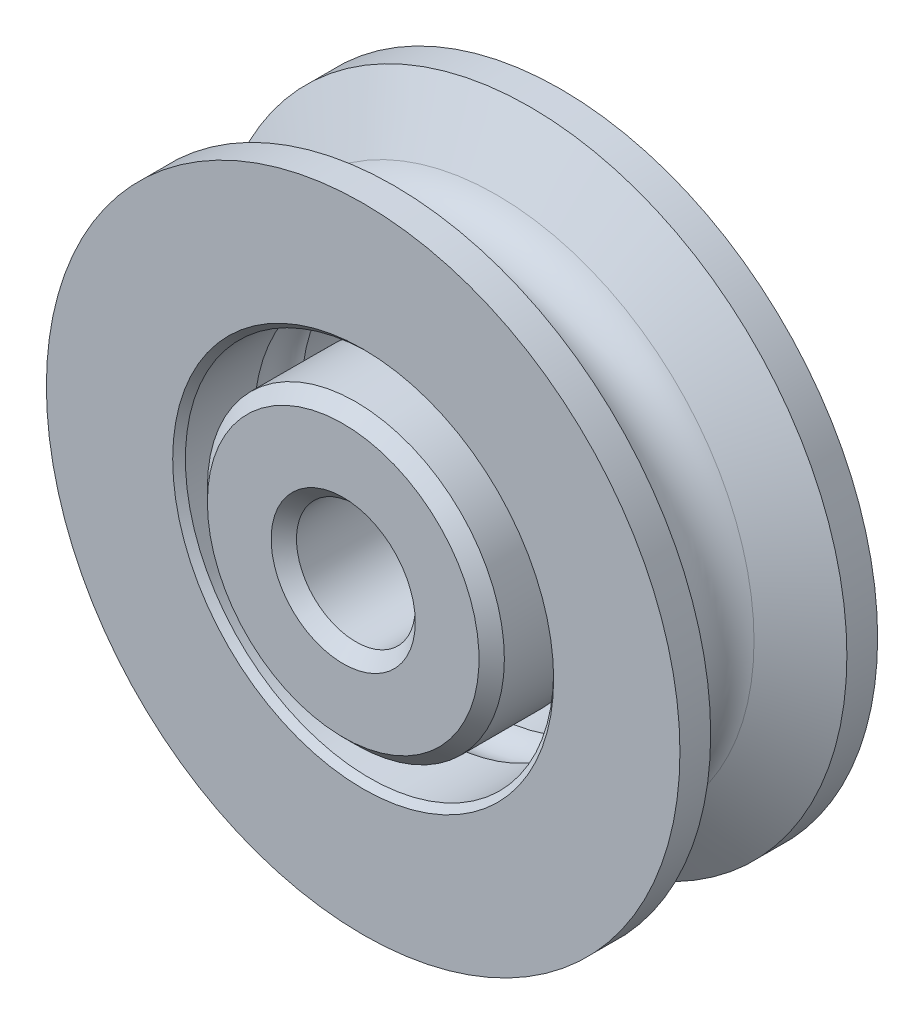
ISO-10303-21;
HEADER;
FILE_DESCRIPTION(('STEP AP214'),'2;1');
FILE_NAME('part.step','',(''),(''),'','','');
FILE_SCHEMA(('AUTOMOTIVE_DESIGN { 1 0 10303 214 1 1 1 1 }'));
ENDSEC;
DATA;
#1=APPLICATION_CONTEXT('core data for automotive mechanical design processes');
#2=APPLICATION_PROTOCOL_DEFINITION('international standard','automotive_design',2000,#1);
#3=PRODUCT_CONTEXT('',#1,'mechanical');
#4=PRODUCT('Part','Part','',(#3));
#5=PRODUCT_RELATED_PRODUCT_CATEGORY('part','',(#4));
#6=PRODUCT_DEFINITION_FORMATION('','',#4);
#7=PRODUCT_DEFINITION_CONTEXT('part definition',#1,'design');
#8=PRODUCT_DEFINITION('design','',#6,#7);
#9=PRODUCT_DEFINITION_SHAPE('','',#8);
#10=(LENGTH_UNIT() NAMED_UNIT(*) SI_UNIT(.MILLI.,.METRE.));
#11=(NAMED_UNIT(*) PLANE_ANGLE_UNIT() SI_UNIT($,.RADIAN.));
#12=(NAMED_UNIT(*) SI_UNIT($,.STERADIAN.) SOLID_ANGLE_UNIT());
#13=UNCERTAINTY_MEASURE_WITH_UNIT(LENGTH_MEASURE(1.E-05),#10,'distance_accuracy_value','');
#14=(GEOMETRIC_REPRESENTATION_CONTEXT(3) GLOBAL_UNCERTAINTY_ASSIGNED_CONTEXT((#13)) GLOBAL_UNIT_ASSIGNED_CONTEXT((#10,
#11,#12)) REPRESENTATION_CONTEXT('',''));
#15=CARTESIAN_POINT('',(0.,0.,0.));
#16=DIRECTION('',(0.,0.,1.));
#17=DIRECTION('',(1.,0.,0.));
#18=AXIS2_PLACEMENT_3D('',#15,#16,#17);
#19=CARTESIAN_POINT('',(0.,0.,4.25450000000183));
#20=DIRECTION('',(0.,0.,-1.));
#21=DIRECTION('',(-1.,0.,0.));
#22=AXIS2_PLACEMENT_3D('',#19,#20,#21);
#23=CONICAL_SURFACE('',#22,5.9531250000191,0.785398163397448);
#24=CARTESIAN_POINT('',(0.,0.,4.7624999999698));
#25=DIRECTION('',(0.,0.,-1.));
#26=DIRECTION('',(-1.,0.,0.));
#27=AXIS2_PLACEMENT_3D('',#24,#25,#26);
#28=CIRCLE('',#27,5.44512500005112);
#29=CARTESIAN_POINT('',(-5.44512500005112,0.,4.7624999999698));
#30=VERTEX_POINT('',#29);
#31=EDGE_CURVE('P0_E18',#30,#30,#28,.T.);
#32=ORIENTED_EDGE('',*,*,#31,.T.);
#33=EDGE_LOOP('',(#32));
#34=FACE_BOUND('',#33,.T.);
#35=CARTESIAN_POINT('',(0.,0.,4.2545));
#36=DIRECTION('',(0.,0.,1.));
#37=DIRECTION('',(1.,0.,0.));
#38=AXIS2_PLACEMENT_3D('',#35,#36,#37);
#39=CIRCLE('',#38,5.953125);
#40=CARTESIAN_POINT('',(5.953125,0.,4.2545));
#41=VERTEX_POINT('',#40);
#42=EDGE_CURVE('P0_E30',#41,#41,#39,.F.);
#43=ORIENTED_EDGE('',*,*,#42,.F.);
#44=EDGE_LOOP('',(#43));
#45=FACE_BOUND('',#44,.T.);
#46=ADVANCED_FACE('P0_F15',(#34,#45),#23,.T.);
#47=CARTESIAN_POINT('',(0.,0.,4.7625));
#48=DIRECTION('',(0.,0.,1.));
#49=DIRECTION('',(1.,0.,0.));
#50=AXIS2_PLACEMENT_3D('',#47,#48,#49);
#51=CYLINDRICAL_SURFACE('',#50,5.953125);
#52=CARTESIAN_POINT('',(0.,0.,0.9525));
#53=DIRECTION('',(0.,0.,1.));
#54=DIRECTION('',(1.,0.,0.));
#55=AXIS2_PLACEMENT_3D('',#52,#53,#54);
#56=CIRCLE('',#55,5.953125);
#57=CARTESIAN_POINT('',(5.953125,0.,0.9525));
#58=VERTEX_POINT('',#57);
#59=EDGE_CURVE('P0_E35',#58,#58,#56,.T.);
#60=ORIENTED_EDGE('',*,*,#59,.T.);
#61=EDGE_LOOP('',(#60));
#62=FACE_BOUND('',#61,.T.);
#63=ORIENTED_EDGE('',*,*,#42,.T.);
#64=EDGE_LOOP('',(#63));
#65=FACE_BOUND('',#64,.T.);
#66=ADVANCED_FACE('P0_F66',(#62,#65),#51,.T.);
#67=CARTESIAN_POINT('',(0.,5.953125,4.7625));
#68=DIRECTION('',(0.,0.,-1.));
#69=DIRECTION('',(-1.,0.,0.));
#70=AXIS2_PLACEMENT_3D('',#67,#68,#69);
#71=PLANE('',#70);
#72=CARTESIAN_POINT('',(0.,0.,4.76250000002665));
#73=DIRECTION('',(0.,0.,1.));
#74=DIRECTION('',(1.,0.,0.));
#75=AXIS2_PLACEMENT_3D('',#72,#73,#74);
#76=CIRCLE('',#75,2.88924999995288);
#77=CARTESIAN_POINT('',(2.88924999995288,0.,4.76250000002665));
#78=VERTEX_POINT('',#77);
#79=EDGE_CURVE('P0_E32',#78,#78,#76,.F.);
#80=ORIENTED_EDGE('',*,*,#79,.T.);
#81=EDGE_LOOP('',(#80));
#82=FACE_BOUND('',#81,.T.);
#83=ORIENTED_EDGE('',*,*,#31,.F.);
#84=EDGE_LOOP('',(#83));
#85=FACE_BOUND('',#84,.T.);
#86=ADVANCED_FACE('P0_F63',(#82,#85),#71,.F.);
#87=CARTESIAN_POINT('',(0.,0.,4.76250000002665));
#88=DIRECTION('',(0.,0.,1.));
#89=DIRECTION('',(1.,0.,0.));
#90=AXIS2_PLACEMENT_3D('',#87,#88,#89);
#91=CONICAL_SURFACE('',#90,2.88924999995288,0.785398163397448);
#92=ORIENTED_EDGE('',*,*,#79,.F.);
#93=EDGE_LOOP('',(#92));
#94=FACE_BOUND('',#93,.T.);
#95=CARTESIAN_POINT('',(0.,0.,4.2545));
#96=DIRECTION('',(0.,0.,1.));
#97=DIRECTION('',(1.,0.,0.));
#98=AXIS2_PLACEMENT_3D('',#95,#96,#97);
#99=CIRCLE('',#98,2.38125);
#100=CARTESIAN_POINT('',(2.38125,0.,4.2545));
#101=VERTEX_POINT('',#100);
#102=EDGE_CURVE('P0_E34',#101,#101,#99,.F.);
#103=ORIENTED_EDGE('',*,*,#102,.T.);
#104=EDGE_LOOP('',(#103));
#105=FACE_BOUND('',#104,.T.);
#106=ADVANCED_FACE('P0_F58',(#94,#105),#91,.F.);
#107=CARTESIAN_POINT('',(0.,0.,0.));
#108=DIRECTION('',(0.,0.,1.));
#109=DIRECTION('',(1.,0.,0.));
#110=AXIS2_PLACEMENT_3D('',#107,#108,#109);
#111=TOROIDAL_SURFACE('',#110,6.6675,1.190625);
#112=ORIENTED_EDGE('',*,*,#59,.F.);
#113=EDGE_LOOP('',(#112));
#114=FACE_BOUND('',#113,.T.);
#115=CARTESIAN_POINT('',(0.,0.,-0.9525));
#116=DIRECTION('',(0.,0.,1.));
#117=DIRECTION('',(1.,0.,0.));
#118=AXIS2_PLACEMENT_3D('',#115,#116,#117);
#119=CIRCLE('',#118,5.953125);
#120=CARTESIAN_POINT('',(5.953125,0.,-0.9525));
#121=VERTEX_POINT('',#120);
#122=EDGE_CURVE('P0_E39',#121,#121,#119,.F.);
#123=ORIENTED_EDGE('',*,*,#122,.F.);
#124=EDGE_LOOP('',(#123));
#125=FACE_BOUND('',#124,.T.);
#126=ADVANCED_FACE('P0_F53',(#114,#125),#111,.F.);
#127=CARTESIAN_POINT('',(0.,0.,4.7625));
#128=DIRECTION('',(0.,0.,1.));
#129=DIRECTION('',(1.,0.,0.));
#130=AXIS2_PLACEMENT_3D('',#127,#128,#129);
#131=CYLINDRICAL_SURFACE('',#130,2.38125);
#132=ORIENTED_EDGE('',*,*,#102,.F.);
#133=EDGE_LOOP('',(#132));
#134=FACE_BOUND('',#133,.T.);
#135=CARTESIAN_POINT('',(0.,0.,-4.25450000005867));
#136=DIRECTION('',(0.,0.,-1.));
#137=DIRECTION('',(-1.,0.,0.));
#138=AXIS2_PLACEMENT_3D('',#135,#136,#137);
#139=CIRCLE('',#138,2.3812499999849);
#140=CARTESIAN_POINT('',(-2.3812499999849,0.,-4.25450000005867));
#141=VERTEX_POINT('',#140);
#142=EDGE_CURVE('P0_E48',#141,#141,#139,.T.);
#143=ORIENTED_EDGE('',*,*,#142,.T.);
#144=EDGE_LOOP('',(#143));
#145=FACE_BOUND('',#144,.T.);
#146=ADVANCED_FACE('P0_F57',(#134,#145),#131,.F.);
#147=CARTESIAN_POINT('',(0.,0.,4.7625));
#148=DIRECTION('',(0.,0.,1.));
#149=DIRECTION('',(1.,0.,0.));
#150=AXIS2_PLACEMENT_3D('',#147,#148,#149);
#151=CYLINDRICAL_SURFACE('',#150,5.953125);
#152=CARTESIAN_POINT('',(0.,0.,-4.25450000005867));
#153=DIRECTION('',(0.,0.,1.));
#154=DIRECTION('',(1.,0.,0.));
#155=AXIS2_PLACEMENT_3D('',#152,#153,#154);
#156=CIRCLE('',#155,5.9531250000191);
#157=CARTESIAN_POINT('',(5.9531250000191,0.,-4.25450000005867));
#158=VERTEX_POINT('',#157);
#159=EDGE_CURVE('P0_E27',#158,#158,#156,.F.);
#160=ORIENTED_EDGE('',*,*,#159,.F.);
#161=EDGE_LOOP('',(#160));
#162=FACE_BOUND('',#161,.T.);
#163=ORIENTED_EDGE('',*,*,#122,.T.);
#164=EDGE_LOOP('',(#163));
#165=FACE_BOUND('',#164,.T.);
#166=ADVANCED_FACE('P0_F87',(#162,#165),#151,.T.);
#167=CARTESIAN_POINT('',(0.,0.,-4.76250000002665));
#168=DIRECTION('',(0.,0.,-1.));
#169=DIRECTION('',(-1.,0.,0.));
#170=AXIS2_PLACEMENT_3D('',#167,#168,#169);
#171=CONICAL_SURFACE('',#170,2.88924999995288,0.785398163397448);
#172=CARTESIAN_POINT('',(0.,0.,-4.76250000002665));
#173=DIRECTION('',(0.,0.,-1.));
#174=DIRECTION('',(-1.,0.,0.));
#175=AXIS2_PLACEMENT_3D('',#172,#173,#174);
#176=CIRCLE('',#175,2.88924999995288);
#177=CARTESIAN_POINT('',(-2.88924999995288,0.,-4.76250000002665));
#178=VERTEX_POINT('',#177);
#179=EDGE_CURVE('P0_E22',#178,#178,#176,.T.);
#180=ORIENTED_EDGE('',*,*,#179,.T.);
#181=EDGE_LOOP('',(#180));
#182=FACE_BOUND('',#181,.T.);
#183=ORIENTED_EDGE('',*,*,#142,.F.);
#184=EDGE_LOOP('',(#183));
#185=FACE_BOUND('',#184,.T.);
#186=ADVANCED_FACE('P0_F82',(#182,#185),#171,.F.);
#187=CARTESIAN_POINT('',(0.,0.,-4.25450000005867));
#188=DIRECTION('',(0.,0.,1.));
#189=DIRECTION('',(1.,0.,0.));
#190=AXIS2_PLACEMENT_3D('',#187,#188,#189);
#191=CONICAL_SURFACE('',#190,5.9531250000191,0.785398163397448);
#192=CARTESIAN_POINT('',(0.,0.,-4.76250000002665));
#193=DIRECTION('',(0.,0.,1.));
#194=DIRECTION('',(1.,0.,0.));
#195=AXIS2_PLACEMENT_3D('',#192,#193,#194);
#196=CIRCLE('',#195,5.44512500005112);
#197=CARTESIAN_POINT('',(5.44512500005112,0.,-4.76250000002665));
#198=VERTEX_POINT('',#197);
#199=EDGE_CURVE('P0_E10',#198,#198,#196,.T.);
#200=ORIENTED_EDGE('',*,*,#199,.T.);
#201=EDGE_LOOP('',(#200));
#202=FACE_BOUND('',#201,.T.);
#203=ORIENTED_EDGE('',*,*,#159,.T.);
#204=EDGE_LOOP('',(#203));
#205=FACE_BOUND('',#204,.T.);
#206=ADVANCED_FACE('P0_F76',(#202,#205),#191,.T.);
#207=CARTESIAN_POINT('',(0.,5.953125,-4.7625));
#208=DIRECTION('',(0.,0.,1.));
#209=DIRECTION('',(1.,0.,0.));
#210=AXIS2_PLACEMENT_3D('',#207,#208,#209);
#211=PLANE('',#210);
#212=ORIENTED_EDGE('',*,*,#199,.F.);
#213=EDGE_LOOP('',(#212));
#214=FACE_BOUND('',#213,.T.);
#215=ORIENTED_EDGE('',*,*,#179,.F.);
#216=EDGE_LOOP('',(#215));
#217=FACE_BOUND('',#216,.T.);
#218=ADVANCED_FACE('P0_F74',(#214,#217),#211,.F.);
#219=CLOSED_SHELL('',(#46,#66,#86,#106,#126,#146,#166,#186,#206,#218));
#220=MANIFOLD_SOLID_BREP('P0_B1',#219);
#221=CARTESIAN_POINT('',(0.,7.381875,3.9624));
#222=DIRECTION('',(0.,0.,-1.));
#223=DIRECTION('',(-1.,0.,0.));
#224=AXIS2_PLACEMENT_3D('',#221,#222,#223);
#225=PLANE('',#224);
#226=CARTESIAN_POINT('',(0.,0.,3.9624));
#227=DIRECTION('',(0.,0.,1.));
#228=DIRECTION('',(1.,0.,0.));
#229=AXIS2_PLACEMENT_3D('',#226,#227,#228);
#230=CIRCLE('',#229,12.7);
#231=CARTESIAN_POINT('',(12.7,0.,3.9624));
#232=VERTEX_POINT('',#231);
#233=EDGE_CURVE('P1_E18',#232,#232,#230,.F.);
#234=ORIENTED_EDGE('',*,*,#233,.F.);
#235=EDGE_LOOP('',(#234));
#236=FACE_BOUND('',#235,.T.);
#237=CARTESIAN_POINT('',(0.,0.,3.9624));
#238=DIRECTION('',(0.,0.,1.));
#239=DIRECTION('',(1.,0.,0.));
#240=AXIS2_PLACEMENT_3D('',#237,#238,#239);
#241=CIRCLE('',#240,7.63587500000001);
#242=CARTESIAN_POINT('',(7.63587500000001,0.,3.9624));
#243=VERTEX_POINT('',#242);
#244=EDGE_CURVE('P1_E32',#243,#243,#241,.F.);
#245=ORIENTED_EDGE('',*,*,#244,.T.);
#246=EDGE_LOOP('',(#245));
#247=FACE_BOUND('',#246,.T.);
#248=ADVANCED_FACE('P1_F15',(#236,#247),#225,.F.);
#249=CARTESIAN_POINT('',(0.,0.,4.7625));
#250=DIRECTION('',(0.,0.,1.));
#251=DIRECTION('',(1.,0.,0.));
#252=AXIS2_PLACEMENT_3D('',#249,#250,#251);
#253=CYLINDRICAL_SURFACE('',#252,12.7);
#254=ORIENTED_EDGE('',*,*,#233,.T.);
#255=EDGE_LOOP('',(#254));
#256=FACE_BOUND('',#255,.T.);
#257=CARTESIAN_POINT('',(0.,0.,2.7305));
#258=DIRECTION('',(0.,0.,1.));
#259=DIRECTION('',(1.,0.,0.));
#260=AXIS2_PLACEMENT_3D('',#257,#258,#259);
#261=CIRCLE('',#260,12.7);
#262=CARTESIAN_POINT('',(12.7,0.,2.7305));
#263=VERTEX_POINT('',#262);
#264=EDGE_CURVE('P1_E30',#263,#263,#261,.F.);
#265=ORIENTED_EDGE('',*,*,#264,.F.);
#266=EDGE_LOOP('',(#265));
#267=FACE_BOUND('',#266,.T.);
#268=ADVANCED_FACE('P1_F41',(#256,#267),#253,.T.);
#269=CARTESIAN_POINT('',(0.,0.,3.9624));
#270=DIRECTION('',(0.,0.,1.));
#271=DIRECTION('',(1.,0.,0.));
#272=AXIS2_PLACEMENT_3D('',#269,#270,#271);
#273=CONICAL_SURFACE('',#272,7.63587500000001,0.785398163397452);
#274=ORIENTED_EDGE('',*,*,#244,.F.);
#275=EDGE_LOOP('',(#274));
#276=FACE_BOUND('',#275,.T.);
#277=CARTESIAN_POINT('',(0.,0.,3.70839999999999));
#278=DIRECTION('',(0.,0.,1.));
#279=DIRECTION('',(1.,0.,0.));
#280=AXIS2_PLACEMENT_3D('',#277,#278,#279);
#281=CIRCLE('',#280,7.381875);
#282=CARTESIAN_POINT('',(7.381875,0.,3.70839999999999));
#283=VERTEX_POINT('',#282);
#284=EDGE_CURVE('P1_E37',#283,#283,#281,.F.);
#285=ORIENTED_EDGE('',*,*,#284,.T.);
#286=EDGE_LOOP('',(#285));
#287=FACE_BOUND('',#286,.T.);
#288=ADVANCED_FACE('P1_F49',(#276,#287),#273,.F.);
#289=CARTESIAN_POINT('',(0.,0.,2.7305));
#290=DIRECTION('',(0.,0.,1.));
#291=DIRECTION('',(1.,0.,0.));
#292=AXIS2_PLACEMENT_3D('',#289,#290,#291);
#293=CONICAL_SURFACE('',#292,12.7,1.0532545428675);
#294=ORIENTED_EDGE('',*,*,#264,.T.);
#295=EDGE_LOOP('',(#294));
#296=FACE_BOUND('',#295,.T.);
#297=CARTESIAN_POINT('',(0.,0.,1.37959781729992));
#298=DIRECTION('',(0.,0.,1.));
#299=DIRECTION('',(1.,0.,0.));
#300=AXIS2_PLACEMENT_3D('',#297,#298,#299);
#301=CIRCLE('',#300,10.3270917542441);
#302=CARTESIAN_POINT('',(10.3270917542441,0.,1.37959781729992));
#303=VERTEX_POINT('',#302);
#304=EDGE_CURVE('P1_E94',#303,#303,#301,.T.);
#305=ORIENTED_EDGE('',*,*,#304,.T.);
#306=EDGE_LOOP('',(#305));
#307=FACE_BOUND('',#306,.T.);
#308=ADVANCED_FACE('P1_F103',(#296,#307),#293,.T.);
#309=CARTESIAN_POINT('',(0.,0.,4.7625));
#310=DIRECTION('',(0.,0.,1.));
#311=DIRECTION('',(1.,0.,0.));
#312=AXIS2_PLACEMENT_3D('',#309,#310,#311);
#313=CYLINDRICAL_SURFACE('',#312,7.381875);
#314=ORIENTED_EDGE('',*,*,#284,.F.);
#315=EDGE_LOOP('',(#314));
#316=FACE_BOUND('',#315,.T.);
#317=CARTESIAN_POINT('',(0.,0.,0.9525));
#318=DIRECTION('',(0.,0.,1.));
#319=DIRECTION('',(1.,0.,0.));
#320=AXIS2_PLACEMENT_3D('',#317,#318,#319);
#321=CIRCLE('',#320,7.381875);
#322=CARTESIAN_POINT('',(7.381875,0.,0.9525));
#323=VERTEX_POINT('',#322);
#324=EDGE_CURVE('P1_E89',#323,#323,#321,.F.);
#325=ORIENTED_EDGE('',*,*,#324,.T.);
#326=EDGE_LOOP('',(#325));
#327=FACE_BOUND('',#326,.T.);
#328=ADVANCED_FACE('P1_F100',(#316,#327),#313,.F.);
#329=CARTESIAN_POINT('',(0.,0.,0.));
#330=DIRECTION('',(0.,0.,1.));
#331=DIRECTION('',(1.,0.,0.));
#332=AXIS2_PLACEMENT_3D('',#329,#330,#331);
#333=TOROIDAL_SURFACE('',#332,6.6675,1.190625);
#334=ORIENTED_EDGE('',*,*,#324,.F.);
#335=EDGE_LOOP('',(#334));
#336=FACE_BOUND('',#335,.T.);
#337=CARTESIAN_POINT('',(0.,0.,-0.9525));
#338=DIRECTION('',(0.,0.,1.));
#339=DIRECTION('',(1.,0.,0.));
#340=AXIS2_PLACEMENT_3D('',#337,#338,#339);
#341=CIRCLE('',#340,7.381875);
#342=CARTESIAN_POINT('',(7.381875,0.,-0.9525));
#343=VERTEX_POINT('',#342);
#344=EDGE_CURVE('P1_E87',#343,#343,#341,.F.);
#345=ORIENTED_EDGE('',*,*,#344,.T.);
#346=EDGE_LOOP('',(#345));
#347=FACE_BOUND('',#346,.T.);
#348=ADVANCED_FACE('P1_F78',(#336,#347),#333,.F.);
#349=CARTESIAN_POINT('',(0.,0.,0.));
#350=DIRECTION('',(0.,0.,1.));
#351=DIRECTION('',(1.,0.,0.));
#352=AXIS2_PLACEMENT_3D('',#349,#350,#351);
#353=TOROIDAL_SURFACE('',#352,11.1125,1.5875);
#354=ORIENTED_EDGE('',*,*,#304,.F.);
#355=EDGE_LOOP('',(#354));
#356=FACE_BOUND('',#355,.T.);
#357=CARTESIAN_POINT('',(0.,0.,-1.37959781729992));
#358=DIRECTION('',(0.,0.,-1.));
#359=DIRECTION('',(-1.,0.,0.));
#360=AXIS2_PLACEMENT_3D('',#357,#358,#359);
#361=CIRCLE('',#360,10.3270917542441);
#362=CARTESIAN_POINT('',(-10.3270917542441,0.,-1.37959781729992));
#363=VERTEX_POINT('',#362);
#364=EDGE_CURVE('P1_E85',#363,#363,#361,.T.);
#365=ORIENTED_EDGE('',*,*,#364,.F.);
#366=EDGE_LOOP('',(#365));
#367=FACE_BOUND('',#366,.T.);
#368=ADVANCED_FACE('P1_F73',(#356,#367),#353,.F.);
#369=CARTESIAN_POINT('',(0.,0.,4.7625));
#370=DIRECTION('',(0.,0.,1.));
#371=DIRECTION('',(1.,0.,0.));
#372=AXIS2_PLACEMENT_3D('',#369,#370,#371);
#373=CYLINDRICAL_SURFACE('',#372,7.381875);
#374=ORIENTED_EDGE('',*,*,#344,.F.);
#375=EDGE_LOOP('',(#374));
#376=FACE_BOUND('',#375,.T.);
#377=CARTESIAN_POINT('',(0.,0.,-3.7084));
#378=DIRECTION('',(0.,0.,-1.));
#379=DIRECTION('',(-1.,0.,0.));
#380=AXIS2_PLACEMENT_3D('',#377,#378,#379);
#381=CIRCLE('',#380,7.381875);
#382=CARTESIAN_POINT('',(-7.381875,0.,-3.7084));
#383=VERTEX_POINT('',#382);
#384=EDGE_CURVE('P1_E112',#383,#383,#381,.T.);
#385=ORIENTED_EDGE('',*,*,#384,.T.);
#386=EDGE_LOOP('',(#385));
#387=FACE_BOUND('',#386,.T.);
#388=ADVANCED_FACE('P1_F69',(#376,#387),#373,.F.);
#389=CARTESIAN_POINT('',(0.,0.,-2.7305));
#390=DIRECTION('',(0.,0.,-1.));
#391=DIRECTION('',(-1.,0.,0.));
#392=AXIS2_PLACEMENT_3D('',#389,#390,#391);
#393=CONICAL_SURFACE('',#392,12.7,1.0532545428675);
#394=CARTESIAN_POINT('',(0.,0.,-2.7305));
#395=DIRECTION('',(0.,0.,1.));
#396=DIRECTION('',(1.,0.,0.));
#397=AXIS2_PLACEMENT_3D('',#394,#395,#396);
#398=CIRCLE('',#397,12.7);
#399=CARTESIAN_POINT('',(12.7,0.,-2.7305));
#400=VERTEX_POINT('',#399);
#401=EDGE_CURVE('P1_E27',#400,#400,#398,.F.);
#402=ORIENTED_EDGE('',*,*,#401,.F.);
#403=EDGE_LOOP('',(#402));
#404=FACE_BOUND('',#403,.T.);
#405=ORIENTED_EDGE('',*,*,#364,.T.);
#406=EDGE_LOOP('',(#405));
#407=FACE_BOUND('',#406,.T.);
#408=ADVANCED_FACE('P1_F65',(#404,#407),#393,.T.);
#409=CARTESIAN_POINT('',(0.,0.,-3.9624));
#410=DIRECTION('',(0.,0.,-1.));
#411=DIRECTION('',(0.,1.,0.));
#412=AXIS2_PLACEMENT_3D('',#409,#410,#411);
#413=CONICAL_SURFACE('',#412,7.63587500000001,0.785398163397452);
#414=CARTESIAN_POINT('',(0.,0.,-3.9624));
#415=DIRECTION('',(0.,0.,-1.));
#416=DIRECTION('',(0.,1.,0.));
#417=AXIS2_PLACEMENT_3D('',#414,#415,#416);
#418=CIRCLE('',#417,7.63587500000001);
#419=CARTESIAN_POINT('',(0.,7.63587500000001,-3.9624));
#420=VERTEX_POINT('',#419);
#421=EDGE_CURVE('P1_E22',#420,#420,#418,.T.);
#422=ORIENTED_EDGE('',*,*,#421,.T.);
#423=EDGE_LOOP('',(#422));
#424=FACE_BOUND('',#423,.T.);
#425=ORIENTED_EDGE('',*,*,#384,.F.);
#426=EDGE_LOOP('',(#425));
#427=FACE_BOUND('',#426,.T.);
#428=ADVANCED_FACE('P1_F58',(#424,#427),#413,.F.);
#429=CARTESIAN_POINT('',(0.,0.,4.7625));
#430=DIRECTION('',(0.,0.,1.));
#431=DIRECTION('',(1.,0.,0.));
#432=AXIS2_PLACEMENT_3D('',#429,#430,#431);
#433=CYLINDRICAL_SURFACE('',#432,12.7);
#434=ORIENTED_EDGE('',*,*,#401,.T.);
#435=EDGE_LOOP('',(#434));
#436=FACE_BOUND('',#435,.T.);
#437=CARTESIAN_POINT('',(0.,0.,-3.9624));
#438=DIRECTION('',(0.,0.,1.));
#439=DIRECTION('',(1.,0.,0.));
#440=AXIS2_PLACEMENT_3D('',#437,#438,#439);
#441=CIRCLE('',#440,12.7);
#442=CARTESIAN_POINT('',(12.7,0.,-3.9624));
#443=VERTEX_POINT('',#442);
#444=EDGE_CURVE('P1_E10',#443,#443,#441,.T.);
#445=ORIENTED_EDGE('',*,*,#444,.T.);
#446=EDGE_LOOP('',(#445));
#447=FACE_BOUND('',#446,.T.);
#448=ADVANCED_FACE('P1_F52',(#436,#447),#433,.T.);
#449=CARTESIAN_POINT('',(0.,12.7,-3.9624));
#450=DIRECTION('',(0.,0.,1.));
#451=DIRECTION('',(1.,0.,0.));
#452=AXIS2_PLACEMENT_3D('',#449,#450,#451);
#453=PLANE('',#452);
#454=ORIENTED_EDGE('',*,*,#444,.F.);
#455=EDGE_LOOP('',(#454));
#456=FACE_BOUND('',#455,.T.);
#457=ORIENTED_EDGE('',*,*,#421,.F.);
#458=EDGE_LOOP('',(#457));
#459=FACE_BOUND('',#458,.T.);
#460=ADVANCED_FACE('P1_F50',(#456,#459),#453,.F.);
#461=CLOSED_SHELL('',(#248,#268,#288,#308,#328,#348,#368,#388,#408,#428,#448,#460));
#462=MANIFOLD_SOLID_BREP('P1_B1',#461);
#463=ADVANCED_BREP_SHAPE_REPRESENTATION('',(#18,#220,#462),#14);
#464=SHAPE_DEFINITION_REPRESENTATION(#9,#463);
ENDSEC;
END-ISO-10303-21;
